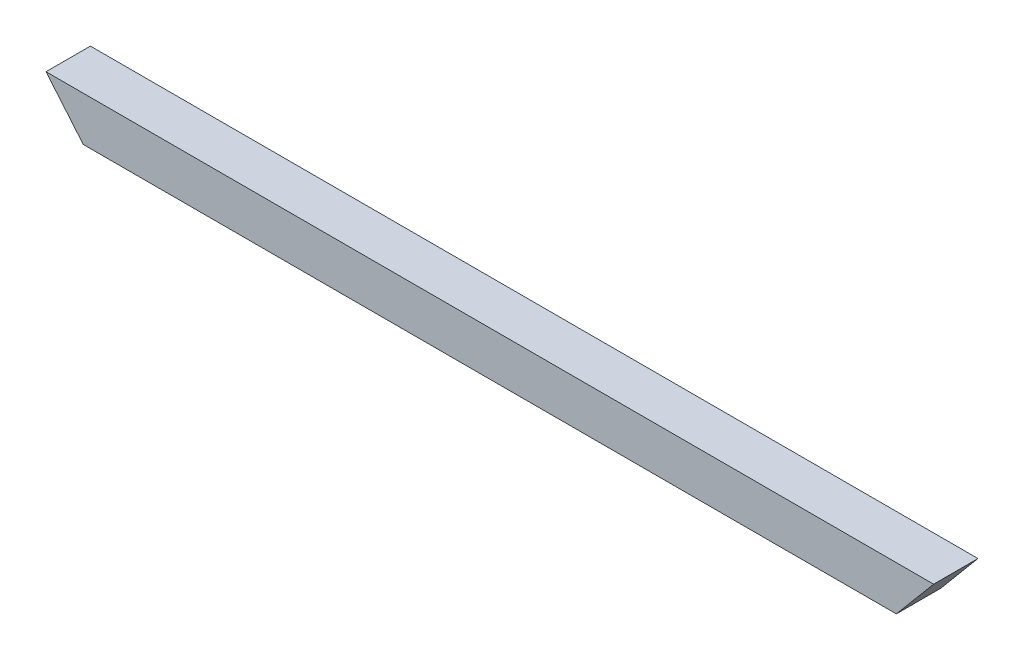
ISO-10303-21;
HEADER;
FILE_DESCRIPTION(('STEP AP214'),'2;1');
FILE_NAME('part.step','',(''),(''),'','','');
FILE_SCHEMA(('AUTOMOTIVE_DESIGN { 1 0 10303 214 1 1 1 1 }'));
ENDSEC;
DATA;
#1=APPLICATION_CONTEXT('core data for automotive mechanical design processes');
#2=APPLICATION_PROTOCOL_DEFINITION('international standard','automotive_design',2000,#1);
#3=PRODUCT_CONTEXT('',#1,'mechanical');
#4=PRODUCT('Part','Part','',(#3));
#5=PRODUCT_RELATED_PRODUCT_CATEGORY('part','',(#4));
#6=PRODUCT_DEFINITION_FORMATION('','',#4);
#7=PRODUCT_DEFINITION_CONTEXT('part definition',#1,'design');
#8=PRODUCT_DEFINITION('design','',#6,#7);
#9=PRODUCT_DEFINITION_SHAPE('','',#8);
#10=(LENGTH_UNIT() NAMED_UNIT(*) SI_UNIT(.MILLI.,.METRE.));
#11=(NAMED_UNIT(*) PLANE_ANGLE_UNIT() SI_UNIT($,.RADIAN.));
#12=(NAMED_UNIT(*) SI_UNIT($,.STERADIAN.) SOLID_ANGLE_UNIT());
#13=UNCERTAINTY_MEASURE_WITH_UNIT(LENGTH_MEASURE(1.E-05),#10,'distance_accuracy_value','');
#14=(GEOMETRIC_REPRESENTATION_CONTEXT(3) GLOBAL_UNCERTAINTY_ASSIGNED_CONTEXT((#13)) GLOBAL_UNIT_ASSIGNED_CONTEXT((#10,
#11,#12)) REPRESENTATION_CONTEXT('',''));
#15=CARTESIAN_POINT('',(0.,0.,0.));
#16=DIRECTION('',(0.,0.,1.));
#17=DIRECTION('',(1.,0.,0.));
#18=AXIS2_PLACEMENT_3D('',#15,#16,#17);
#19=CARTESIAN_POINT('',(-31.9696959478542,38.1,-38.1));
#20=DIRECTION('',(0.,-1.,0.));
#21=DIRECTION('',(0.,0.,-1.));
#22=AXIS2_PLACEMENT_3D('',#19,#20,#21);
#23=PLANE('',#22);
#24=DIRECTION('',(1.,0.,0.));
#25=VECTOR('',#24,1.);
#26=CARTESIAN_POINT('',(-31.9696959478542,38.1,0.));
#27=LINE('',#26,#25);
#28=CARTESIAN_POINT('',(-31.9696959478542,38.1,0.));
#29=VERTEX_POINT('',#28);
#30=CARTESIAN_POINT('',(730.030304052146,38.1,0.));
#31=VERTEX_POINT('',#30);
#32=EDGE_CURVE('E107',#29,#31,#27,.T.);
#33=ORIENTED_EDGE('',*,*,#32,.T.);
#34=DIRECTION('',(0.,0.,1.));
#35=VECTOR('',#34,1.);
#36=CARTESIAN_POINT('',(730.030304052146,38.1,-38.1));
#37=LINE('',#36,#35);
#38=CARTESIAN_POINT('',(730.030304052146,38.1,-38.1));
#39=VERTEX_POINT('',#38);
#40=EDGE_CURVE('E11',#39,#31,#37,.T.);
#41=ORIENTED_EDGE('',*,*,#40,.F.);
#42=DIRECTION('',(1.,0.,0.));
#43=VECTOR('',#42,1.);
#44=CARTESIAN_POINT('',(-31.9696959478542,38.1,-38.1));
#45=LINE('',#44,#43);
#46=CARTESIAN_POINT('',(-31.9696959478542,38.1,-38.1));
#47=VERTEX_POINT('',#46);
#48=EDGE_CURVE('E91',#47,#39,#45,.T.);
#49=ORIENTED_EDGE('',*,*,#48,.F.);
#50=DIRECTION('',(0.,0.,1.));
#51=VECTOR('',#50,1.);
#52=CARTESIAN_POINT('',(-31.9696959478542,38.1,-38.1));
#53=LINE('',#52,#51);
#54=EDGE_CURVE('E103',#47,#29,#53,.T.);
#55=ORIENTED_EDGE('',*,*,#54,.T.);
#56=EDGE_LOOP('',(#33,#41,#49,#55));
#57=FACE_BOUND('',#56,.T.);
#58=ADVANCED_FACE('F39',(#57),#23,.F.);
#59=CARTESIAN_POINT('',(730.030304052146,38.1,-38.1));
#60=DIRECTION('',(-0.766044443118979,0.642787609686538,0.));
#61=DIRECTION('',(-0.642787609686538,-0.766044443118979,0.));
#62=AXIS2_PLACEMENT_3D('',#59,#60,#61);
#63=PLANE('',#62);
#64=DIRECTION('',(-0.642787609686538,-0.766044443118979,0.));
#65=VECTOR('',#64,1.);
#66=CARTESIAN_POINT('',(730.030304052146,38.1,0.));
#67=LINE('',#66,#65);
#68=CARTESIAN_POINT('',(698.060608104292,0.,0.));
#69=VERTEX_POINT('',#68);
#70=EDGE_CURVE('E96',#31,#69,#67,.T.);
#71=ORIENTED_EDGE('',*,*,#70,.T.);
#72=DIRECTION('',(0.,0.,1.));
#73=VECTOR('',#72,1.);
#74=CARTESIAN_POINT('',(698.060608104292,0.,-38.1));
#75=LINE('',#74,#73);
#76=CARTESIAN_POINT('',(698.060608104292,0.,-38.1));
#77=VERTEX_POINT('',#76);
#78=EDGE_CURVE('E48',#77,#69,#75,.T.);
#79=ORIENTED_EDGE('',*,*,#78,.F.);
#80=DIRECTION('',(-0.642787609686538,-0.766044443118979,0.));
#81=VECTOR('',#80,1.);
#82=CARTESIAN_POINT('',(730.030304052146,38.1,-38.1));
#83=LINE('',#82,#81);
#84=EDGE_CURVE('E86',#39,#77,#83,.T.);
#85=ORIENTED_EDGE('',*,*,#84,.F.);
#86=ORIENTED_EDGE('',*,*,#40,.T.);
#87=EDGE_LOOP('',(#71,#79,#85,#86));
#88=FACE_BOUND('',#87,.T.);
#89=ADVANCED_FACE('F95',(#88),#63,.F.);
#90=CARTESIAN_POINT('',(0.,0.,-38.1));
#91=DIRECTION('',(0.,1.,0.));
#92=DIRECTION('',(0.,0.,1.));
#93=AXIS2_PLACEMENT_3D('',#90,#91,#92);
#94=PLANE('',#93);
#95=DIRECTION('',(-1.,0.,0.));
#96=VECTOR('',#95,1.);
#97=CARTESIAN_POINT('',(0.,0.,0.));
#98=LINE('',#97,#96);
#99=CARTESIAN_POINT('',(0.,0.,0.));
#100=VERTEX_POINT('',#99);
#101=EDGE_CURVE('E73',#69,#100,#98,.T.);
#102=ORIENTED_EDGE('',*,*,#101,.T.);
#103=DIRECTION('',(0.,0.,1.));
#104=VECTOR('',#103,1.);
#105=CARTESIAN_POINT('',(0.,0.,-38.1));
#106=LINE('',#105,#104);
#107=CARTESIAN_POINT('',(0.,0.,-38.1));
#108=VERTEX_POINT('',#107);
#109=EDGE_CURVE('E98',#108,#100,#106,.T.);
#110=ORIENTED_EDGE('',*,*,#109,.F.);
#111=DIRECTION('',(-1.,0.,0.));
#112=VECTOR('',#111,1.);
#113=CARTESIAN_POINT('',(0.,0.,-38.1));
#114=LINE('',#113,#112);
#115=EDGE_CURVE('E89',#77,#108,#114,.T.);
#116=ORIENTED_EDGE('',*,*,#115,.F.);
#117=ORIENTED_EDGE('',*,*,#78,.T.);
#118=EDGE_LOOP('',(#102,#110,#116,#117));
#119=FACE_BOUND('',#118,.T.);
#120=ADVANCED_FACE('F99',(#119),#94,.F.);
#121=CARTESIAN_POINT('',(-31.9696959478542,38.1,-38.1));
#122=DIRECTION('',(0.766044443118979,0.642787609686538,0.));
#123=DIRECTION('',(-0.642787609686538,0.766044443118979,0.));
#124=AXIS2_PLACEMENT_3D('',#121,#122,#123);
#125=PLANE('',#124);
#126=DIRECTION('',(-0.642787609686538,0.766044443118979,0.));
#127=VECTOR('',#126,1.);
#128=CARTESIAN_POINT('',(-31.9696959478542,38.1,0.));
#129=LINE('',#128,#127);
#130=EDGE_CURVE('E79',#100,#29,#129,.T.);
#131=ORIENTED_EDGE('',*,*,#130,.T.);
#132=ORIENTED_EDGE('',*,*,#54,.F.);
#133=DIRECTION('',(-0.642787609686538,0.766044443118979,0.));
#134=VECTOR('',#133,1.);
#135=CARTESIAN_POINT('',(-31.9696959478542,38.1,-38.1));
#136=LINE('',#135,#134);
#137=EDGE_CURVE('E56',#108,#47,#136,.T.);
#138=ORIENTED_EDGE('',*,*,#137,.F.);
#139=ORIENTED_EDGE('',*,*,#109,.T.);
#140=EDGE_LOOP('',(#131,#132,#138,#139));
#141=FACE_BOUND('',#140,.T.);
#142=ADVANCED_FACE('F120',(#141),#125,.F.);
#143=CARTESIAN_POINT('',(0.,0.,-38.1));
#144=DIRECTION('',(0.,0.,-1.));
#145=DIRECTION('',(-1.,0.,0.));
#146=AXIS2_PLACEMENT_3D('',#143,#144,#145);
#147=PLANE('',#146);
#148=ORIENTED_EDGE('',*,*,#48,.T.);
#149=ORIENTED_EDGE('',*,*,#84,.T.);
#150=ORIENTED_EDGE('',*,*,#115,.T.);
#151=ORIENTED_EDGE('',*,*,#137,.T.);
#152=EDGE_LOOP('',(#148,#149,#150,#151));
#153=FACE_BOUND('',#152,.T.);
#154=ADVANCED_FACE('F87',(#153),#147,.T.);
#155=CARTESIAN_POINT('',(0.,0.,0.));
#156=DIRECTION('',(0.,0.,-1.));
#157=DIRECTION('',(-1.,0.,0.));
#158=AXIS2_PLACEMENT_3D('',#155,#156,#157);
#159=PLANE('',#158);
#160=ORIENTED_EDGE('',*,*,#32,.F.);
#161=ORIENTED_EDGE('',*,*,#130,.F.);
#162=ORIENTED_EDGE('',*,*,#101,.F.);
#163=ORIENTED_EDGE('',*,*,#70,.F.);
#164=EDGE_LOOP('',(#160,#161,#162,#163));
#165=FACE_BOUND('',#164,.T.);
#166=ADVANCED_FACE('F123',(#165),#159,.F.);
#167=CLOSED_SHELL('',(#58,#89,#120,#142,#154,#166));
#168=MANIFOLD_SOLID_BREP('B2',#167);
#169=ADVANCED_BREP_SHAPE_REPRESENTATION('',(#18,#168),#14);
#170=SHAPE_DEFINITION_REPRESENTATION(#9,#169);
ENDSEC;
END-ISO-10303-21;
